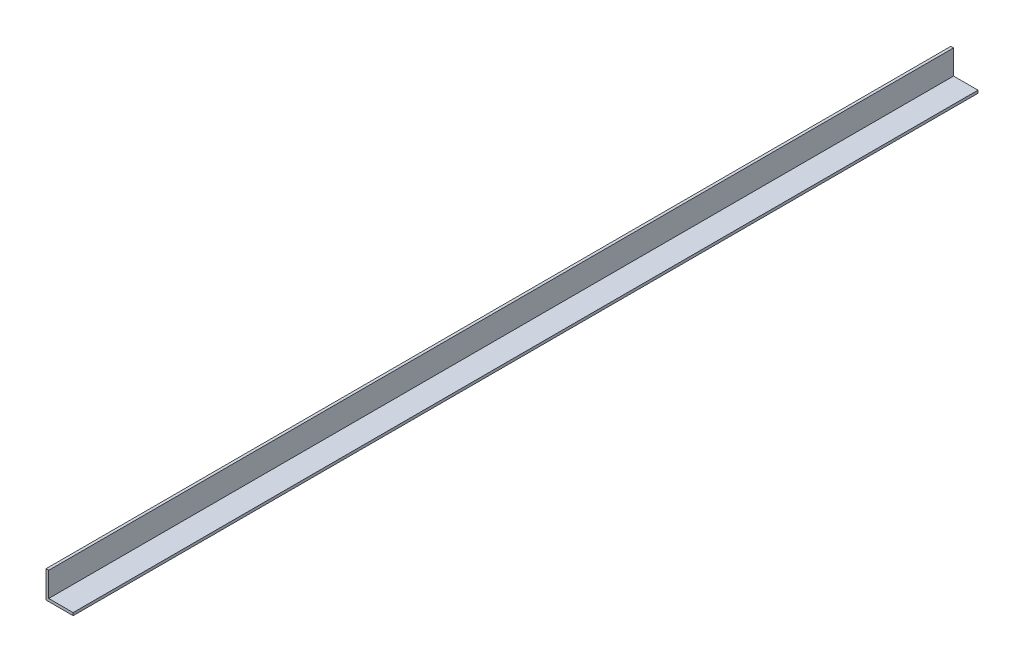
ISO-10303-21;
HEADER;
FILE_DESCRIPTION(('STEP AP214'),'2;1');
FILE_NAME('part.step','',(''),(''),'','','');
FILE_SCHEMA(('AUTOMOTIVE_DESIGN { 1 0 10303 214 1 1 1 1 }'));
ENDSEC;
DATA;
#1=APPLICATION_CONTEXT('core data for automotive mechanical design processes');
#2=APPLICATION_PROTOCOL_DEFINITION('international standard','automotive_design',2000,#1);
#3=PRODUCT_CONTEXT('',#1,'mechanical');
#4=PRODUCT('Part','Part','',(#3));
#5=PRODUCT_RELATED_PRODUCT_CATEGORY('part','',(#4));
#6=PRODUCT_DEFINITION_FORMATION('','',#4);
#7=PRODUCT_DEFINITION_CONTEXT('part definition',#1,'design');
#8=PRODUCT_DEFINITION('design','',#6,#7);
#9=PRODUCT_DEFINITION_SHAPE('','',#8);
#10=(LENGTH_UNIT() NAMED_UNIT(*) SI_UNIT(.MILLI.,.METRE.));
#11=(NAMED_UNIT(*) PLANE_ANGLE_UNIT() SI_UNIT($,.RADIAN.));
#12=(NAMED_UNIT(*) SI_UNIT($,.STERADIAN.) SOLID_ANGLE_UNIT());
#13=UNCERTAINTY_MEASURE_WITH_UNIT(LENGTH_MEASURE(1.E-05),#10,'distance_accuracy_value','');
#14=(GEOMETRIC_REPRESENTATION_CONTEXT(3) GLOBAL_UNCERTAINTY_ASSIGNED_CONTEXT((#13)) GLOBAL_UNIT_ASSIGNED_CONTEXT((#10,
#11,#12)) REPRESENTATION_CONTEXT('',''));
#15=CARTESIAN_POINT('',(0.,0.,0.));
#16=DIRECTION('',(0.,0.,1.));
#17=DIRECTION('',(1.,0.,0.));
#18=AXIS2_PLACEMENT_3D('',#15,#16,#17);
#19=CARTESIAN_POINT('',(3.,30.,1000.));
#20=DIRECTION('',(0.,-1.,0.));
#21=DIRECTION('',(0.,0.,-1.));
#22=AXIS2_PLACEMENT_3D('',#19,#20,#21);
#23=PLANE('',#22);
#24=DIRECTION('',(-1.,0.,0.));
#25=VECTOR('',#24,1.);
#26=CARTESIAN_POINT('',(3.,30.,0.));
#27=LINE('',#26,#25);
#28=CARTESIAN_POINT('',(3.,30.,0.));
#29=VERTEX_POINT('',#28);
#30=CARTESIAN_POINT('',(0.,30.,0.));
#31=VERTEX_POINT('',#30);
#32=EDGE_CURVE('E118',#29,#31,#27,.T.);
#33=ORIENTED_EDGE('',*,*,#32,.T.);
#34=DIRECTION('',(0.,0.,-1.));
#35=VECTOR('',#34,1.);
#36=CARTESIAN_POINT('',(0.,30.,1000.));
#37=LINE('',#36,#35);
#38=CARTESIAN_POINT('',(0.,30.,1000.));
#39=VERTEX_POINT('',#38);
#40=EDGE_CURVE('E11',#39,#31,#37,.T.);
#41=ORIENTED_EDGE('',*,*,#40,.F.);
#42=DIRECTION('',(-1.,0.,0.));
#43=VECTOR('',#42,1.);
#44=CARTESIAN_POINT('',(3.,30.,1000.));
#45=LINE('',#44,#43);
#46=CARTESIAN_POINT('',(3.,30.,1000.));
#47=VERTEX_POINT('',#46);
#48=EDGE_CURVE('E128',#47,#39,#45,.T.);
#49=ORIENTED_EDGE('',*,*,#48,.F.);
#50=DIRECTION('',(0.,0.,-1.));
#51=VECTOR('',#50,1.);
#52=CARTESIAN_POINT('',(3.,30.,1000.));
#53=LINE('',#52,#51);
#54=EDGE_CURVE('E114',#47,#29,#53,.T.);
#55=ORIENTED_EDGE('',*,*,#54,.T.);
#56=EDGE_LOOP('',(#33,#41,#49,#55));
#57=FACE_BOUND('',#56,.T.);
#58=ADVANCED_FACE('F34',(#57),#23,.F.);
#59=CARTESIAN_POINT('',(0.,30.,1000.));
#60=DIRECTION('',(1.,0.,0.));
#61=DIRECTION('',(0.,0.,-1.));
#62=AXIS2_PLACEMENT_3D('',#59,#60,#61);
#63=PLANE('',#62);
#64=DIRECTION('',(0.,-1.,0.));
#65=VECTOR('',#64,1.);
#66=CARTESIAN_POINT('',(0.,30.,0.));
#67=LINE('',#66,#65);
#68=CARTESIAN_POINT('',(0.,0.,0.));
#69=VERTEX_POINT('',#68);
#70=EDGE_CURVE('E121',#31,#69,#67,.T.);
#71=ORIENTED_EDGE('',*,*,#70,.T.);
#72=DIRECTION('',(0.,0.,-1.));
#73=VECTOR('',#72,1.);
#74=CARTESIAN_POINT('',(0.,0.,1000.));
#75=LINE('',#74,#73);
#76=CARTESIAN_POINT('',(0.,0.,1000.));
#77=VERTEX_POINT('',#76);
#78=EDGE_CURVE('E42',#77,#69,#75,.T.);
#79=ORIENTED_EDGE('',*,*,#78,.F.);
#80=DIRECTION('',(0.,-1.,0.));
#81=VECTOR('',#80,1.);
#82=CARTESIAN_POINT('',(0.,30.,1000.));
#83=LINE('',#82,#81);
#84=EDGE_CURVE('E87',#39,#77,#83,.T.);
#85=ORIENTED_EDGE('',*,*,#84,.F.);
#86=ORIENTED_EDGE('',*,*,#40,.T.);
#87=EDGE_LOOP('',(#71,#79,#85,#86));
#88=FACE_BOUND('',#87,.T.);
#89=ADVANCED_FACE('F152',(#88),#63,.F.);
#90=CARTESIAN_POINT('',(0.,0.,1000.));
#91=DIRECTION('',(0.,1.,0.));
#92=DIRECTION('',(0.,0.,1.));
#93=AXIS2_PLACEMENT_3D('',#90,#91,#92);
#94=PLANE('',#93);
#95=DIRECTION('',(1.,0.,0.));
#96=VECTOR('',#95,1.);
#97=CARTESIAN_POINT('',(0.,0.,0.));
#98=LINE('',#97,#96);
#99=CARTESIAN_POINT('',(30.,0.,0.));
#100=VERTEX_POINT('',#99);
#101=EDGE_CURVE('E123',#69,#100,#98,.T.);
#102=ORIENTED_EDGE('',*,*,#101,.T.);
#103=DIRECTION('',(0.,0.,-1.));
#104=VECTOR('',#103,1.);
#105=CARTESIAN_POINT('',(30.,0.,1000.));
#106=LINE('',#105,#104);
#107=CARTESIAN_POINT('',(30.,0.,1000.));
#108=VERTEX_POINT('',#107);
#109=EDGE_CURVE('E109',#108,#100,#106,.T.);
#110=ORIENTED_EDGE('',*,*,#109,.F.);
#111=DIRECTION('',(1.,0.,0.));
#112=VECTOR('',#111,1.);
#113=CARTESIAN_POINT('',(0.,0.,1000.));
#114=LINE('',#113,#112);
#115=EDGE_CURVE('E100',#77,#108,#114,.T.);
#116=ORIENTED_EDGE('',*,*,#115,.F.);
#117=ORIENTED_EDGE('',*,*,#78,.T.);
#118=EDGE_LOOP('',(#102,#110,#116,#117));
#119=FACE_BOUND('',#118,.T.);
#120=ADVANCED_FACE('F134',(#119),#94,.F.);
#121=CARTESIAN_POINT('',(30.,0.,1000.));
#122=DIRECTION('',(-1.,0.,0.));
#123=DIRECTION('',(0.,0.,1.));
#124=AXIS2_PLACEMENT_3D('',#121,#122,#123);
#125=PLANE('',#124);
#126=DIRECTION('',(0.,1.,0.));
#127=VECTOR('',#126,1.);
#128=CARTESIAN_POINT('',(30.,0.,0.));
#129=LINE('',#128,#127);
#130=CARTESIAN_POINT('',(30.,3.,0.));
#131=VERTEX_POINT('',#130);
#132=EDGE_CURVE('E108',#100,#131,#129,.T.);
#133=ORIENTED_EDGE('',*,*,#132,.T.);
#134=DIRECTION('',(0.,0.,-1.));
#135=VECTOR('',#134,1.);
#136=CARTESIAN_POINT('',(30.,3.,1000.));
#137=LINE('',#136,#135);
#138=CARTESIAN_POINT('',(30.,3.,1000.));
#139=VERTEX_POINT('',#138);
#140=EDGE_CURVE('E105',#139,#131,#137,.T.);
#141=ORIENTED_EDGE('',*,*,#140,.F.);
#142=DIRECTION('',(0.,1.,0.));
#143=VECTOR('',#142,1.);
#144=CARTESIAN_POINT('',(30.,0.,1000.));
#145=LINE('',#144,#143);
#146=EDGE_CURVE('E94',#108,#139,#145,.T.);
#147=ORIENTED_EDGE('',*,*,#146,.F.);
#148=ORIENTED_EDGE('',*,*,#109,.T.);
#149=EDGE_LOOP('',(#133,#141,#147,#148));
#150=FACE_BOUND('',#149,.T.);
#151=ADVANCED_FACE('F106',(#150),#125,.F.);
#152=CARTESIAN_POINT('',(30.,3.,1000.));
#153=DIRECTION('',(0.,-1.,0.));
#154=DIRECTION('',(1.,0.,0.));
#155=AXIS2_PLACEMENT_3D('',#152,#153,#154);
#156=PLANE('',#155);
#157=DIRECTION('',(-1.,0.,0.));
#158=VECTOR('',#157,1.);
#159=CARTESIAN_POINT('',(30.,3.,0.));
#160=LINE('',#159,#158);
#161=CARTESIAN_POINT('',(3.,3.,0.));
#162=VERTEX_POINT('',#161);
#163=EDGE_CURVE('E73',#131,#162,#160,.T.);
#164=ORIENTED_EDGE('',*,*,#163,.T.);
#165=DIRECTION('',(0.,0.,-1.));
#166=VECTOR('',#165,1.);
#167=CARTESIAN_POINT('',(3.,3.,1000.));
#168=LINE('',#167,#166);
#169=CARTESIAN_POINT('',(3.,3.,1000.));
#170=VERTEX_POINT('',#169);
#171=EDGE_CURVE('E110',#170,#162,#168,.T.);
#172=ORIENTED_EDGE('',*,*,#171,.F.);
#173=DIRECTION('',(-1.,0.,0.));
#174=VECTOR('',#173,1.);
#175=CARTESIAN_POINT('',(30.,3.,1000.));
#176=LINE('',#175,#174);
#177=EDGE_CURVE('E98',#139,#170,#176,.T.);
#178=ORIENTED_EDGE('',*,*,#177,.F.);
#179=ORIENTED_EDGE('',*,*,#140,.T.);
#180=EDGE_LOOP('',(#164,#172,#178,#179));
#181=FACE_BOUND('',#180,.T.);
#182=ADVANCED_FACE('F112',(#181),#156,.F.);
#183=CARTESIAN_POINT('',(3.,3.,1000.));
#184=DIRECTION('',(-1.,0.,0.));
#185=DIRECTION('',(0.,-1.,0.));
#186=AXIS2_PLACEMENT_3D('',#183,#184,#185);
#187=PLANE('',#186);
#188=DIRECTION('',(0.,1.,0.));
#189=VECTOR('',#188,1.);
#190=CARTESIAN_POINT('',(3.,3.,0.));
#191=LINE('',#190,#189);
#192=EDGE_CURVE('E79',#162,#29,#191,.T.);
#193=ORIENTED_EDGE('',*,*,#192,.T.);
#194=ORIENTED_EDGE('',*,*,#54,.F.);
#195=DIRECTION('',(0.,1.,0.));
#196=VECTOR('',#195,1.);
#197=CARTESIAN_POINT('',(3.,3.,1000.));
#198=LINE('',#197,#196);
#199=EDGE_CURVE('E50',#170,#47,#198,.T.);
#200=ORIENTED_EDGE('',*,*,#199,.F.);
#201=ORIENTED_EDGE('',*,*,#171,.T.);
#202=EDGE_LOOP('',(#193,#194,#200,#201));
#203=FACE_BOUND('',#202,.T.);
#204=ADVANCED_FACE('F141',(#203),#187,.F.);
#205=CARTESIAN_POINT('',(0.,0.,1000.));
#206=DIRECTION('',(0.,0.,1.));
#207=DIRECTION('',(1.,0.,0.));
#208=AXIS2_PLACEMENT_3D('',#205,#206,#207);
#209=PLANE('',#208);
#210=ORIENTED_EDGE('',*,*,#48,.T.);
#211=ORIENTED_EDGE('',*,*,#84,.T.);
#212=ORIENTED_EDGE('',*,*,#115,.T.);
#213=ORIENTED_EDGE('',*,*,#146,.T.);
#214=ORIENTED_EDGE('',*,*,#177,.T.);
#215=ORIENTED_EDGE('',*,*,#199,.T.);
#216=EDGE_LOOP('',(#210,#211,#212,#213,#214,#215));
#217=FACE_BOUND('',#216,.T.);
#218=ADVANCED_FACE('F96',(#217),#209,.T.);
#219=CARTESIAN_POINT('',(0.,0.,0.));
#220=DIRECTION('',(0.,0.,1.));
#221=DIRECTION('',(1.,0.,0.));
#222=AXIS2_PLACEMENT_3D('',#219,#220,#221);
#223=PLANE('',#222);
#224=ORIENTED_EDGE('',*,*,#32,.F.);
#225=ORIENTED_EDGE('',*,*,#192,.F.);
#226=ORIENTED_EDGE('',*,*,#163,.F.);
#227=ORIENTED_EDGE('',*,*,#132,.F.);
#228=ORIENTED_EDGE('',*,*,#101,.F.);
#229=ORIENTED_EDGE('',*,*,#70,.F.);
#230=EDGE_LOOP('',(#224,#225,#226,#227,#228,#229));
#231=FACE_BOUND('',#230,.T.);
#232=ADVANCED_FACE('F137',(#231),#223,.F.);
#233=CLOSED_SHELL('',(#58,#89,#120,#151,#182,#204,#218,#232));
#234=MANIFOLD_SOLID_BREP('B2',#233);
#235=ADVANCED_BREP_SHAPE_REPRESENTATION('',(#18,#234),#14);
#236=SHAPE_DEFINITION_REPRESENTATION(#9,#235);
ENDSEC;
END-ISO-10303-21;
